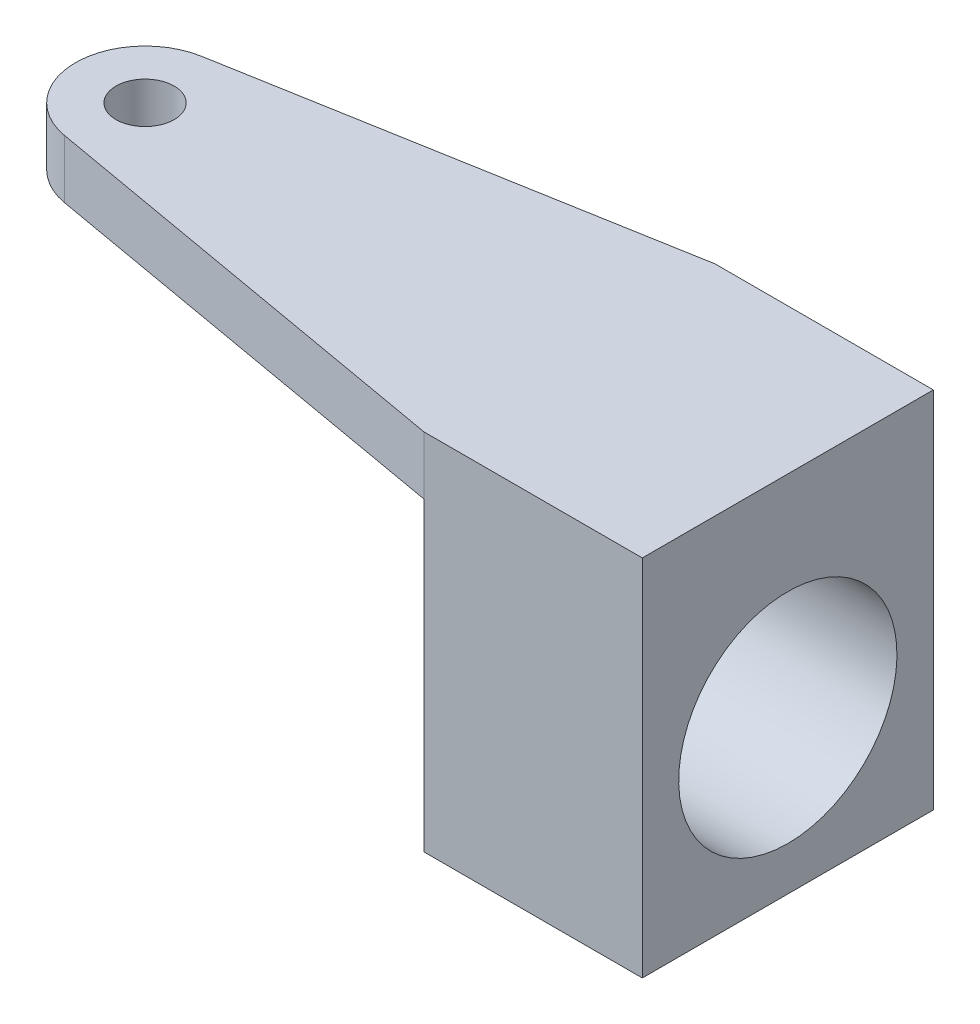
ISO-10303-21;
HEADER;
FILE_DESCRIPTION(('STEP AP214'),'2;1');
FILE_NAME('part.step','',(''),(''),'','','');
FILE_SCHEMA(('AUTOMOTIVE_DESIGN { 1 0 10303 214 1 1 1 1 }'));
ENDSEC;
DATA;
#1=APPLICATION_CONTEXT('core data for automotive mechanical design processes');
#2=APPLICATION_PROTOCOL_DEFINITION('international standard','automotive_design',2000,#1);
#3=PRODUCT_CONTEXT('',#1,'mechanical');
#4=PRODUCT('Part','Part','',(#3));
#5=PRODUCT_RELATED_PRODUCT_CATEGORY('part','',(#4));
#6=PRODUCT_DEFINITION_FORMATION('','',#4);
#7=PRODUCT_DEFINITION_CONTEXT('part definition',#1,'design');
#8=PRODUCT_DEFINITION('design','',#6,#7);
#9=PRODUCT_DEFINITION_SHAPE('','',#8);
#10=(LENGTH_UNIT() NAMED_UNIT(*) SI_UNIT(.MILLI.,.METRE.));
#11=(NAMED_UNIT(*) PLANE_ANGLE_UNIT() SI_UNIT($,.RADIAN.));
#12=(NAMED_UNIT(*) SI_UNIT($,.STERADIAN.) SOLID_ANGLE_UNIT());
#13=UNCERTAINTY_MEASURE_WITH_UNIT(LENGTH_MEASURE(1.E-05),#10,'distance_accuracy_value','');
#14=(GEOMETRIC_REPRESENTATION_CONTEXT(3) GLOBAL_UNCERTAINTY_ASSIGNED_CONTEXT((#13)) GLOBAL_UNIT_ASSIGNED_CONTEXT((#10,
#11,#12)) REPRESENTATION_CONTEXT('',''));
#15=CARTESIAN_POINT('',(0.,0.,0.));
#16=DIRECTION('',(0.,0.,1.));
#17=DIRECTION('',(1.,0.,0.));
#18=AXIS2_PLACEMENT_3D('',#15,#16,#17);
#19=CARTESIAN_POINT('',(0.,-125.,0.));
#20=DIRECTION('',(0.,1.,0.));
#21=DIRECTION('',(0.,0.,1.));
#22=AXIS2_PLACEMENT_3D('',#19,#20,#21);
#23=PLANE('',#22);
#24=DIRECTION('',(-1.,0.,0.));
#25=VECTOR('',#24,1.);
#26=CARTESIAN_POINT('',(145.847331583441,-125.,50.));
#27=LINE('',#26,#25);
#28=CARTESIAN_POINT('',(220.847331583441,-125.,50.));
#29=VERTEX_POINT('',#28);
#30=CARTESIAN_POINT('',(145.847331583441,-125.,50.));
#31=VERTEX_POINT('',#30);
#32=EDGE_CURVE('E165',#29,#31,#27,.T.);
#33=ORIENTED_EDGE('',*,*,#32,.T.);
#34=DIRECTION('',(0.,0.,1.));
#35=VECTOR('',#34,1.);
#36=CARTESIAN_POINT('',(145.847331583441,-125.,-50.));
#37=LINE('',#36,#35);
#38=CARTESIAN_POINT('',(145.847331583441,-125.,-50.));
#39=VERTEX_POINT('',#38);
#40=EDGE_CURVE('E159',#39,#31,#37,.T.);
#41=ORIENTED_EDGE('',*,*,#40,.F.);
#42=DIRECTION('',(1.,0.,0.));
#43=VECTOR('',#42,1.);
#44=CARTESIAN_POINT('',(220.847331583441,-125.,-50.));
#45=LINE('',#44,#43);
#46=CARTESIAN_POINT('',(220.847331583441,-125.,-50.));
#47=VERTEX_POINT('',#46);
#48=EDGE_CURVE('E59',#39,#47,#45,.T.);
#49=ORIENTED_EDGE('',*,*,#48,.T.);
#50=DIRECTION('',(0.,0.,1.));
#51=VECTOR('',#50,1.);
#52=CARTESIAN_POINT('',(220.847331583441,-125.,50.));
#53=LINE('',#52,#51);
#54=EDGE_CURVE('E96',#47,#29,#53,.T.);
#55=ORIENTED_EDGE('',*,*,#54,.T.);
#56=EDGE_LOOP('',(#33,#41,#49,#55));
#57=FACE_BOUND('',#56,.T.);
#58=ADVANCED_FACE('F34',(#57),#23,.F.);
#59=CARTESIAN_POINT('',(0.,0.,0.));
#60=DIRECTION('',(0.,1.,0.));
#61=DIRECTION('',(0.,0.,1.));
#62=AXIS2_PLACEMENT_3D('',#59,#60,#61);
#63=PLANE('',#62);
#64=DIRECTION('',(0.,0.,1.));
#65=VECTOR('',#64,1.);
#66=CARTESIAN_POINT('',(220.847331583441,0.,50.));
#67=LINE('',#66,#65);
#68=CARTESIAN_POINT('',(220.847331583441,0.,-50.));
#69=VERTEX_POINT('',#68);
#70=CARTESIAN_POINT('',(220.847331583441,0.,50.));
#71=VERTEX_POINT('',#70);
#72=EDGE_CURVE('E102',#69,#71,#67,.T.);
#73=ORIENTED_EDGE('',*,*,#72,.F.);
#74=DIRECTION('',(1.,0.,0.));
#75=VECTOR('',#74,1.);
#76=CARTESIAN_POINT('',(220.847331583441,0.,-50.));
#77=LINE('',#76,#75);
#78=CARTESIAN_POINT('',(145.847331583441,0.,-50.));
#79=VERTEX_POINT('',#78);
#80=EDGE_CURVE('E84',#79,#69,#77,.T.);
#81=ORIENTED_EDGE('',*,*,#80,.F.);
#82=DIRECTION('',(0.984807753012208,0.,-0.173648177666931));
#83=VECTOR('',#82,1.);
#84=CARTESIAN_POINT('',(145.847331583441,0.,-50.));
#85=LINE('',#84,#83);
#86=CARTESIAN_POINT('',(-4.15266841655876,0.,-23.5509528937301));
#87=VERTEX_POINT('',#86);
#88=EDGE_CURVE('E97',#87,#79,#85,.T.);
#89=ORIENTED_EDGE('',*,*,#88,.F.);
#90=CARTESIAN_POINT('',(0.,0.,0.));
#91=DIRECTION('',(0.,-1.,0.));
#92=DIRECTION('',(0.,0.,1.));
#93=AXIS2_PLACEMENT_3D('',#90,#91,#92);
#94=CIRCLE('',#93,23.9142643035612);
#95=CARTESIAN_POINT('',(-4.15266841655876,0.,23.5509528937301));
#96=VERTEX_POINT('',#95);
#97=EDGE_CURVE('E120',#96,#87,#94,.T.);
#98=ORIENTED_EDGE('',*,*,#97,.F.);
#99=DIRECTION('',(-0.984807753012208,0.,-0.173648177666931));
#100=VECTOR('',#99,1.);
#101=CARTESIAN_POINT('',(-4.15266841655877,0.,23.5509528937301));
#102=LINE('',#101,#100);
#103=CARTESIAN_POINT('',(145.847331583441,0.,50.));
#104=VERTEX_POINT('',#103);
#105=EDGE_CURVE('E111',#104,#96,#102,.T.);
#106=ORIENTED_EDGE('',*,*,#105,.F.);
#107=DIRECTION('',(-1.,0.,0.));
#108=VECTOR('',#107,1.);
#109=CARTESIAN_POINT('',(145.847331583441,0.,50.));
#110=LINE('',#109,#108);
#111=EDGE_CURVE('E108',#71,#104,#110,.T.);
#112=ORIENTED_EDGE('',*,*,#111,.F.);
#113=EDGE_LOOP('',(#73,#81,#89,#98,#106,#112));
#114=FACE_BOUND('',#113,.T.);
#115=CARTESIAN_POINT('',(0.,0.,0.));
#116=DIRECTION('',(0.,-1.,0.));
#117=DIRECTION('',(0.,0.,-1.));
#118=AXIS2_PLACEMENT_3D('',#115,#116,#117);
#119=CIRCLE('',#118,10.);
#120=CARTESIAN_POINT('',(0.,0.,-10.));
#121=VERTEX_POINT('',#120);
#122=EDGE_CURVE('E109',#121,#121,#119,.T.);
#123=ORIENTED_EDGE('',*,*,#122,.T.);
#124=EDGE_LOOP('',(#123));
#125=FACE_BOUND('',#124,.T.);
#126=ADVANCED_FACE('F104',(#114,#125),#63,.T.);
#127=CARTESIAN_POINT('',(220.847331583441,-125.,50.));
#128=DIRECTION('',(-1.,0.,0.));
#129=DIRECTION('',(0.,0.,1.));
#130=AXIS2_PLACEMENT_3D('',#127,#128,#129);
#131=PLANE('',#130);
#132=CARTESIAN_POINT('',(220.847331583441,-72.5,0.));
#133=DIRECTION('',(-1.,0.,0.));
#134=DIRECTION('',(0.,-1.,0.));
#135=AXIS2_PLACEMENT_3D('',#132,#133,#134);
#136=CIRCLE('',#135,37.5);
#137=CARTESIAN_POINT('',(220.847331583441,-110.,0.));
#138=VERTEX_POINT('',#137);
#139=EDGE_CURVE('E163',#138,#138,#136,.T.);
#140=ORIENTED_EDGE('',*,*,#139,.T.);
#141=EDGE_LOOP('',(#140));
#142=FACE_BOUND('',#141,.T.);
#143=ORIENTED_EDGE('',*,*,#72,.T.);
#144=DIRECTION('',(0.,1.,0.));
#145=VECTOR('',#144,1.);
#146=CARTESIAN_POINT('',(220.847331583441,-125.,50.));
#147=LINE('',#146,#145);
#148=EDGE_CURVE('E12',#29,#71,#147,.T.);
#149=ORIENTED_EDGE('',*,*,#148,.F.);
#150=ORIENTED_EDGE('',*,*,#54,.F.);
#151=DIRECTION('',(0.,1.,0.));
#152=VECTOR('',#151,1.);
#153=CARTESIAN_POINT('',(220.847331583441,-125.,-50.));
#154=LINE('',#153,#152);
#155=EDGE_CURVE('E87',#47,#69,#154,.T.);
#156=ORIENTED_EDGE('',*,*,#155,.T.);
#157=EDGE_LOOP('',(#143,#149,#150,#156));
#158=FACE_BOUND('',#157,.T.);
#159=ADVANCED_FACE('F36',(#142,#158),#131,.F.);
#160=CARTESIAN_POINT('',(145.847331583441,-125.,50.));
#161=DIRECTION('',(0.,0.,-1.));
#162=DIRECTION('',(-1.,0.,0.));
#163=AXIS2_PLACEMENT_3D('',#160,#161,#162);
#164=PLANE('',#163);
#165=ORIENTED_EDGE('',*,*,#111,.T.);
#166=DIRECTION('',(0.,1.,0.));
#167=VECTOR('',#166,1.);
#168=CARTESIAN_POINT('',(145.847331583441,-125.,50.));
#169=LINE('',#168,#167);
#170=CARTESIAN_POINT('',(145.847331583441,-20.,50.));
#171=VERTEX_POINT('',#170);
#172=EDGE_CURVE('E130',#171,#104,#169,.T.);
#173=ORIENTED_EDGE('',*,*,#172,.F.);
#174=EDGE_CURVE('E43',#31,#171,#169,.T.);
#175=ORIENTED_EDGE('',*,*,#174,.F.);
#176=ORIENTED_EDGE('',*,*,#32,.F.);
#177=ORIENTED_EDGE('',*,*,#148,.T.);
#178=EDGE_LOOP('',(#165,#173,#175,#176,#177));
#179=FACE_BOUND('',#178,.T.);
#180=ADVANCED_FACE('F145',(#179),#164,.F.);
#181=CARTESIAN_POINT('',(-4.15266841655877,-125.,23.5509528937301));
#182=DIRECTION('',(0.173648177666931,0.,-0.984807753012208));
#183=DIRECTION('',(-0.984807753012208,0.,-0.173648177666931));
#184=AXIS2_PLACEMENT_3D('',#181,#182,#183);
#185=PLANE('',#184);
#186=DIRECTION('',(0.,1.,0.));
#187=VECTOR('',#186,1.);
#188=CARTESIAN_POINT('',(-4.15266841655876,-125.,23.5509528937301));
#189=LINE('',#188,#187);
#190=CARTESIAN_POINT('',(-4.15266841655879,-20.,23.5509528937301));
#191=VERTEX_POINT('',#190);
#192=EDGE_CURVE('E128',#191,#96,#189,.T.);
#193=ORIENTED_EDGE('',*,*,#192,.F.);
#194=DIRECTION('',(-0.984807753012208,0.,-0.173648177666931));
#195=VECTOR('',#194,1.);
#196=CARTESIAN_POINT('',(145.847331583441,-20.,50.));
#197=LINE('',#196,#195);
#198=EDGE_CURVE('E143',#171,#191,#197,.T.);
#199=ORIENTED_EDGE('',*,*,#198,.F.);
#200=ORIENTED_EDGE('',*,*,#172,.T.);
#201=ORIENTED_EDGE('',*,*,#105,.T.);
#202=EDGE_LOOP('',(#193,#199,#200,#201));
#203=FACE_BOUND('',#202,.T.);
#204=ADVANCED_FACE('F140',(#203),#185,.F.);
#205=CARTESIAN_POINT('',(0.,-125.,0.));
#206=DIRECTION('',(0.,1.,0.));
#207=DIRECTION('',(0.,0.,1.));
#208=AXIS2_PLACEMENT_3D('',#205,#206,#207);
#209=CYLINDRICAL_SURFACE('',#208,23.9142643035612);
#210=DIRECTION('',(0.,1.,0.));
#211=VECTOR('',#210,1.);
#212=CARTESIAN_POINT('',(-4.15266841655876,-125.,-23.5509528937301));
#213=LINE('',#212,#211);
#214=CARTESIAN_POINT('',(-4.15266841655878,-20.,-23.5509528937301));
#215=VERTEX_POINT('',#214);
#216=EDGE_CURVE('E126',#215,#87,#213,.T.);
#217=ORIENTED_EDGE('',*,*,#216,.F.);
#218=CARTESIAN_POINT('',(0.,-20.,0.));
#219=DIRECTION('',(0.,1.,0.));
#220=DIRECTION('',(0.,0.,1.));
#221=AXIS2_PLACEMENT_3D('',#218,#219,#220);
#222=CIRCLE('',#221,23.9142643035612);
#223=EDGE_CURVE('E152',#191,#215,#222,.F.);
#224=ORIENTED_EDGE('',*,*,#223,.F.);
#225=ORIENTED_EDGE('',*,*,#192,.T.);
#226=ORIENTED_EDGE('',*,*,#97,.T.);
#227=EDGE_LOOP('',(#217,#224,#225,#226));
#228=FACE_BOUND('',#227,.T.);
#229=ADVANCED_FACE('F148',(#228),#209,.T.);
#230=CARTESIAN_POINT('',(145.847331583441,-125.,-50.));
#231=DIRECTION('',(0.173648177666931,0.,0.984807753012208));
#232=DIRECTION('',(0.984807753012208,0.,-0.173648177666931));
#233=AXIS2_PLACEMENT_3D('',#230,#231,#232);
#234=PLANE('',#233);
#235=DIRECTION('',(0.,1.,0.));
#236=VECTOR('',#235,1.);
#237=CARTESIAN_POINT('',(145.847331583441,-125.,-50.));
#238=LINE('',#237,#236);
#239=CARTESIAN_POINT('',(145.847331583441,-20.,-50.));
#240=VERTEX_POINT('',#239);
#241=EDGE_CURVE('E91',#240,#79,#238,.T.);
#242=ORIENTED_EDGE('',*,*,#241,.F.);
#243=DIRECTION('',(0.984807753012208,0.,-0.173648177666931));
#244=VECTOR('',#243,1.);
#245=CARTESIAN_POINT('',(-4.15266841655879,-20.,-23.5509528937301));
#246=LINE('',#245,#244);
#247=EDGE_CURVE('E50',#215,#240,#246,.T.);
#248=ORIENTED_EDGE('',*,*,#247,.F.);
#249=ORIENTED_EDGE('',*,*,#216,.T.);
#250=ORIENTED_EDGE('',*,*,#88,.T.);
#251=EDGE_LOOP('',(#242,#248,#249,#250));
#252=FACE_BOUND('',#251,.T.);
#253=ADVANCED_FACE('F204',(#252),#234,.F.);
#254=CARTESIAN_POINT('',(220.847331583441,-125.,-50.));
#255=DIRECTION('',(0.,0.,1.));
#256=DIRECTION('',(1.,0.,0.));
#257=AXIS2_PLACEMENT_3D('',#254,#255,#256);
#258=PLANE('',#257);
#259=ORIENTED_EDGE('',*,*,#80,.T.);
#260=ORIENTED_EDGE('',*,*,#155,.F.);
#261=ORIENTED_EDGE('',*,*,#48,.F.);
#262=EDGE_CURVE('E124',#39,#240,#238,.T.);
#263=ORIENTED_EDGE('',*,*,#262,.T.);
#264=ORIENTED_EDGE('',*,*,#241,.T.);
#265=EDGE_LOOP('',(#259,#260,#261,#263,#264));
#266=FACE_BOUND('',#265,.T.);
#267=ADVANCED_FACE('F86',(#266),#258,.F.);
#268=CARTESIAN_POINT('',(0.,-125.,0.));
#269=DIRECTION('',(0.,1.,0.));
#270=DIRECTION('',(0.,0.,1.));
#271=AXIS2_PLACEMENT_3D('',#268,#269,#270);
#272=CYLINDRICAL_SURFACE('',#271,10.);
#273=CARTESIAN_POINT('',(0.,-20.,0.));
#274=DIRECTION('',(0.,1.,0.));
#275=DIRECTION('',(0.,0.,1.));
#276=AXIS2_PLACEMENT_3D('',#273,#274,#275);
#277=CIRCLE('',#276,10.);
#278=CARTESIAN_POINT('',(0.,-20.,10.));
#279=VERTEX_POINT('',#278);
#280=EDGE_CURVE('E38',#279,#279,#277,.T.);
#281=ORIENTED_EDGE('',*,*,#280,.F.);
#282=EDGE_LOOP('',(#281));
#283=FACE_BOUND('',#282,.T.);
#284=ORIENTED_EDGE('',*,*,#122,.F.);
#285=EDGE_LOOP('',(#284));
#286=FACE_BOUND('',#285,.T.);
#287=ADVANCED_FACE('F191',(#283,#286),#272,.F.);
#288=CARTESIAN_POINT('',(0.,-20.,0.));
#289=DIRECTION('',(0.,1.,0.));
#290=DIRECTION('',(0.,0.,1.));
#291=AXIS2_PLACEMENT_3D('',#288,#289,#290);
#292=PLANE('',#291);
#293=ORIENTED_EDGE('',*,*,#280,.T.);
#294=EDGE_LOOP('',(#293));
#295=FACE_BOUND('',#294,.T.);
#296=ORIENTED_EDGE('',*,*,#247,.T.);
#297=DIRECTION('',(0.,0.,1.));
#298=VECTOR('',#297,1.);
#299=CARTESIAN_POINT('',(145.847331583441,-20.,-50.));
#300=LINE('',#299,#298);
#301=EDGE_CURVE('E162',#240,#171,#300,.T.);
#302=ORIENTED_EDGE('',*,*,#301,.T.);
#303=ORIENTED_EDGE('',*,*,#198,.T.);
#304=ORIENTED_EDGE('',*,*,#223,.T.);
#305=EDGE_LOOP('',(#296,#302,#303,#304));
#306=FACE_BOUND('',#305,.T.);
#307=ADVANCED_FACE('F186',(#295,#306),#292,.F.);
#308=CARTESIAN_POINT('',(145.847331583441,197.025377649941,-50.));
#309=DIRECTION('',(1.,0.,0.));
#310=DIRECTION('',(0.,1.,0.));
#311=AXIS2_PLACEMENT_3D('',#308,#309,#310);
#312=PLANE('',#311);
#313=CARTESIAN_POINT('',(145.847331583441,-72.5,0.));
#314=DIRECTION('',(-1.,0.,0.));
#315=DIRECTION('',(0.,-1.,0.));
#316=AXIS2_PLACEMENT_3D('',#313,#314,#315);
#317=CIRCLE('',#316,37.5);
#318=CARTESIAN_POINT('',(145.847331583441,-110.,0.));
#319=VERTEX_POINT('',#318);
#320=EDGE_CURVE('E172',#319,#319,#317,.T.);
#321=ORIENTED_EDGE('',*,*,#320,.F.);
#322=EDGE_LOOP('',(#321));
#323=FACE_BOUND('',#322,.T.);
#324=ORIENTED_EDGE('',*,*,#262,.F.);
#325=ORIENTED_EDGE('',*,*,#40,.T.);
#326=ORIENTED_EDGE('',*,*,#174,.T.);
#327=ORIENTED_EDGE('',*,*,#301,.F.);
#328=EDGE_LOOP('',(#324,#325,#326,#327));
#329=FACE_BOUND('',#328,.T.);
#330=ADVANCED_FACE('F161',(#323,#329),#312,.F.);
#331=CARTESIAN_POINT('',(220.847331583441,-72.5,0.));
#332=DIRECTION('',(-1.,0.,0.));
#333=DIRECTION('',(0.,-1.,0.));
#334=AXIS2_PLACEMENT_3D('',#331,#332,#333);
#335=CYLINDRICAL_SURFACE('',#334,37.5);
#336=ORIENTED_EDGE('',*,*,#139,.F.);
#337=EDGE_LOOP('',(#336));
#338=FACE_BOUND('',#337,.T.);
#339=ORIENTED_EDGE('',*,*,#320,.T.);
#340=EDGE_LOOP('',(#339));
#341=FACE_BOUND('',#340,.T.);
#342=ADVANCED_FACE('F179',(#338,#341),#335,.F.);
#343=CLOSED_SHELL('',(#58,#126,#159,#180,#204,#229,#253,#267,#287,#307,#330,#342));
#344=MANIFOLD_SOLID_BREP('B2',#343);
#345=ADVANCED_BREP_SHAPE_REPRESENTATION('',(#18,#344),#14);
#346=SHAPE_DEFINITION_REPRESENTATION(#9,#345);
ENDSEC;
END-ISO-10303-21;
